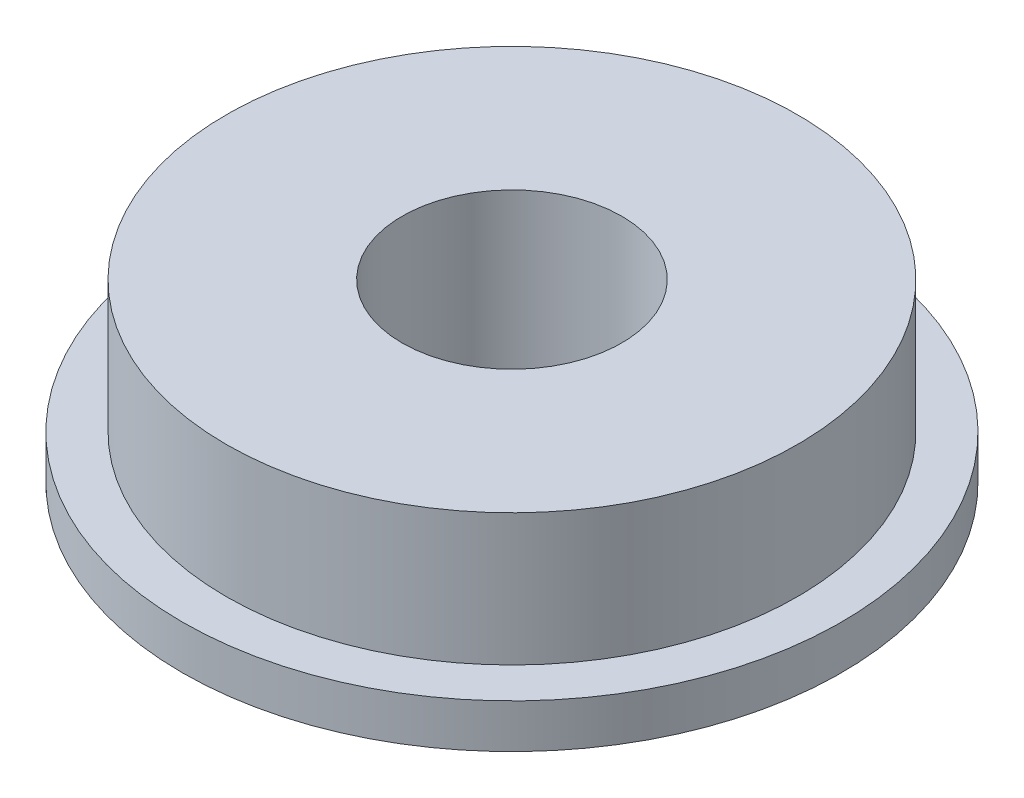
ISO-10303-21;
HEADER;
FILE_DESCRIPTION(('STEP AP214'),'2;1');
FILE_NAME('part.step','',(''),(''),'','','');
FILE_SCHEMA(('AUTOMOTIVE_DESIGN { 1 0 10303 214 1 1 1 1 }'));
ENDSEC;
DATA;
#1=APPLICATION_CONTEXT('core data for automotive mechanical design processes');
#2=APPLICATION_PROTOCOL_DEFINITION('international standard','automotive_design',2000,#1);
#3=PRODUCT_CONTEXT('',#1,'mechanical');
#4=PRODUCT('Part','Part','',(#3));
#5=PRODUCT_RELATED_PRODUCT_CATEGORY('part','',(#4));
#6=PRODUCT_DEFINITION_FORMATION('','',#4);
#7=PRODUCT_DEFINITION_CONTEXT('part definition',#1,'design');
#8=PRODUCT_DEFINITION('design','',#6,#7);
#9=PRODUCT_DEFINITION_SHAPE('','',#8);
#10=(LENGTH_UNIT() NAMED_UNIT(*) SI_UNIT(.MILLI.,.METRE.));
#11=(NAMED_UNIT(*) PLANE_ANGLE_UNIT() SI_UNIT($,.RADIAN.));
#12=(NAMED_UNIT(*) SI_UNIT($,.STERADIAN.) SOLID_ANGLE_UNIT());
#13=UNCERTAINTY_MEASURE_WITH_UNIT(LENGTH_MEASURE(1.E-05),#10,'distance_accuracy_value','');
#14=(GEOMETRIC_REPRESENTATION_CONTEXT(3) GLOBAL_UNCERTAINTY_ASSIGNED_CONTEXT((#13)) GLOBAL_UNIT_ASSIGNED_CONTEXT((#10,
#11,#12)) REPRESENTATION_CONTEXT('',''));
#15=CARTESIAN_POINT('',(0.,0.,0.));
#16=DIRECTION('',(0.,0.,1.));
#17=DIRECTION('',(1.,0.,0.));
#18=AXIS2_PLACEMENT_3D('',#15,#16,#17);
#19=CARTESIAN_POINT('',(0.,4.,0.));
#20=DIRECTION('',(0.,1.,0.));
#21=DIRECTION('',(0.,0.,1.));
#22=AXIS2_PLACEMENT_3D('',#19,#20,#21);
#23=CYLINDRICAL_SURFACE('',#22,7.5);
#24=CARTESIAN_POINT('',(0.,1.,0.));
#25=DIRECTION('',(0.,1.,0.));
#26=DIRECTION('',(0.,0.,1.));
#27=AXIS2_PLACEMENT_3D('',#24,#25,#26);
#28=CIRCLE('',#27,7.5);
#29=CARTESIAN_POINT('',(0.,1.,7.5));
#30=VERTEX_POINT('',#29);
#31=EDGE_CURVE('E10',#30,#30,#28,.T.);
#32=ORIENTED_EDGE('',*,*,#31,.F.);
#33=EDGE_LOOP('',(#32));
#34=FACE_BOUND('',#33,.T.);
#35=CARTESIAN_POINT('',(0.,0.,0.));
#36=DIRECTION('',(0.,1.,0.));
#37=DIRECTION('',(0.,0.,1.));
#38=AXIS2_PLACEMENT_3D('',#35,#36,#37);
#39=CIRCLE('',#38,7.5);
#40=CARTESIAN_POINT('',(0.,0.,7.5));
#41=VERTEX_POINT('',#40);
#42=EDGE_CURVE('E55',#41,#41,#39,.T.);
#43=ORIENTED_EDGE('',*,*,#42,.T.);
#44=EDGE_LOOP('',(#43));
#45=FACE_BOUND('',#44,.T.);
#46=ADVANCED_FACE('F33',(#34,#45),#23,.T.);
#47=CARTESIAN_POINT('',(7.5,1.,0.));
#48=DIRECTION('',(0.,-1.,0.));
#49=DIRECTION('',(0.,0.,-1.));
#50=AXIS2_PLACEMENT_3D('',#47,#48,#49);
#51=PLANE('',#50);
#52=CARTESIAN_POINT('',(0.,1.,0.));
#53=DIRECTION('',(0.,1.,0.));
#54=DIRECTION('',(0.,0.,1.));
#55=AXIS2_PLACEMENT_3D('',#52,#53,#54);
#56=CIRCLE('',#55,6.5);
#57=CARTESIAN_POINT('',(0.,1.,6.5));
#58=VERTEX_POINT('',#57);
#59=EDGE_CURVE('E39',#58,#58,#56,.T.);
#60=ORIENTED_EDGE('',*,*,#59,.F.);
#61=EDGE_LOOP('',(#60));
#62=FACE_BOUND('',#61,.T.);
#63=ORIENTED_EDGE('',*,*,#31,.T.);
#64=EDGE_LOOP('',(#63));
#65=FACE_BOUND('',#64,.T.);
#66=ADVANCED_FACE('F80',(#62,#65),#51,.F.);
#67=CARTESIAN_POINT('',(0.,4.,0.));
#68=DIRECTION('',(0.,1.,0.));
#69=DIRECTION('',(0.,0.,1.));
#70=AXIS2_PLACEMENT_3D('',#67,#68,#69);
#71=CYLINDRICAL_SURFACE('',#70,6.5);
#72=CARTESIAN_POINT('',(0.,4.,0.));
#73=DIRECTION('',(0.,1.,0.));
#74=DIRECTION('',(0.,0.,1.));
#75=AXIS2_PLACEMENT_3D('',#72,#73,#74);
#76=CIRCLE('',#75,6.5);
#77=CARTESIAN_POINT('',(0.,4.,6.5));
#78=VERTEX_POINT('',#77);
#79=EDGE_CURVE('E43',#78,#78,#76,.T.);
#80=ORIENTED_EDGE('',*,*,#79,.F.);
#81=EDGE_LOOP('',(#80));
#82=FACE_BOUND('',#81,.T.);
#83=ORIENTED_EDGE('',*,*,#59,.T.);
#84=EDGE_LOOP('',(#83));
#85=FACE_BOUND('',#84,.T.);
#86=ADVANCED_FACE('F75',(#82,#85),#71,.T.);
#87=CARTESIAN_POINT('',(6.5,4.,0.));
#88=DIRECTION('',(0.,-1.,0.));
#89=DIRECTION('',(0.,0.,-1.));
#90=AXIS2_PLACEMENT_3D('',#87,#88,#89);
#91=PLANE('',#90);
#92=CARTESIAN_POINT('',(0.,4.,0.));
#93=DIRECTION('',(0.,1.,0.));
#94=DIRECTION('',(0.,0.,1.));
#95=AXIS2_PLACEMENT_3D('',#92,#93,#94);
#96=CIRCLE('',#95,2.5);
#97=CARTESIAN_POINT('',(0.,4.,2.5));
#98=VERTEX_POINT('',#97);
#99=EDGE_CURVE('E47',#98,#98,#96,.T.);
#100=ORIENTED_EDGE('',*,*,#99,.F.);
#101=EDGE_LOOP('',(#100));
#102=FACE_BOUND('',#101,.T.);
#103=ORIENTED_EDGE('',*,*,#79,.T.);
#104=EDGE_LOOP('',(#103));
#105=FACE_BOUND('',#104,.T.);
#106=ADVANCED_FACE('F69',(#102,#105),#91,.F.);
#107=CARTESIAN_POINT('',(0.,4.,0.));
#108=DIRECTION('',(0.,1.,0.));
#109=DIRECTION('',(0.,0.,1.));
#110=AXIS2_PLACEMENT_3D('',#107,#108,#109);
#111=CYLINDRICAL_SURFACE('',#110,2.5);
#112=CARTESIAN_POINT('',(0.,0.,0.));
#113=DIRECTION('',(0.,1.,0.));
#114=DIRECTION('',(0.,0.,1.));
#115=AXIS2_PLACEMENT_3D('',#112,#113,#114);
#116=CIRCLE('',#115,2.5);
#117=CARTESIAN_POINT('',(0.,0.,2.5));
#118=VERTEX_POINT('',#117);
#119=EDGE_CURVE('E52',#118,#118,#116,.T.);
#120=ORIENTED_EDGE('',*,*,#119,.F.);
#121=EDGE_LOOP('',(#120));
#122=FACE_BOUND('',#121,.T.);
#123=ORIENTED_EDGE('',*,*,#99,.T.);
#124=EDGE_LOOP('',(#123));
#125=FACE_BOUND('',#124,.T.);
#126=ADVANCED_FACE('F63',(#122,#125),#111,.F.);
#127=CARTESIAN_POINT('',(2.5,0.,0.));
#128=DIRECTION('',(0.,1.,0.));
#129=DIRECTION('',(0.,0.,1.));
#130=AXIS2_PLACEMENT_3D('',#127,#128,#129);
#131=PLANE('',#130);
#132=ORIENTED_EDGE('',*,*,#42,.F.);
#133=EDGE_LOOP('',(#132));
#134=FACE_BOUND('',#133,.T.);
#135=ORIENTED_EDGE('',*,*,#119,.T.);
#136=EDGE_LOOP('',(#135));
#137=FACE_BOUND('',#136,.T.);
#138=ADVANCED_FACE('F60',(#134,#137),#131,.F.);
#139=CLOSED_SHELL('',(#46,#66,#86,#106,#126,#138));
#140=MANIFOLD_SOLID_BREP('B2',#139);
#141=ADVANCED_BREP_SHAPE_REPRESENTATION('',(#18,#140),#14);
#142=SHAPE_DEFINITION_REPRESENTATION(#9,#141);
ENDSEC;
END-ISO-10303-21;
